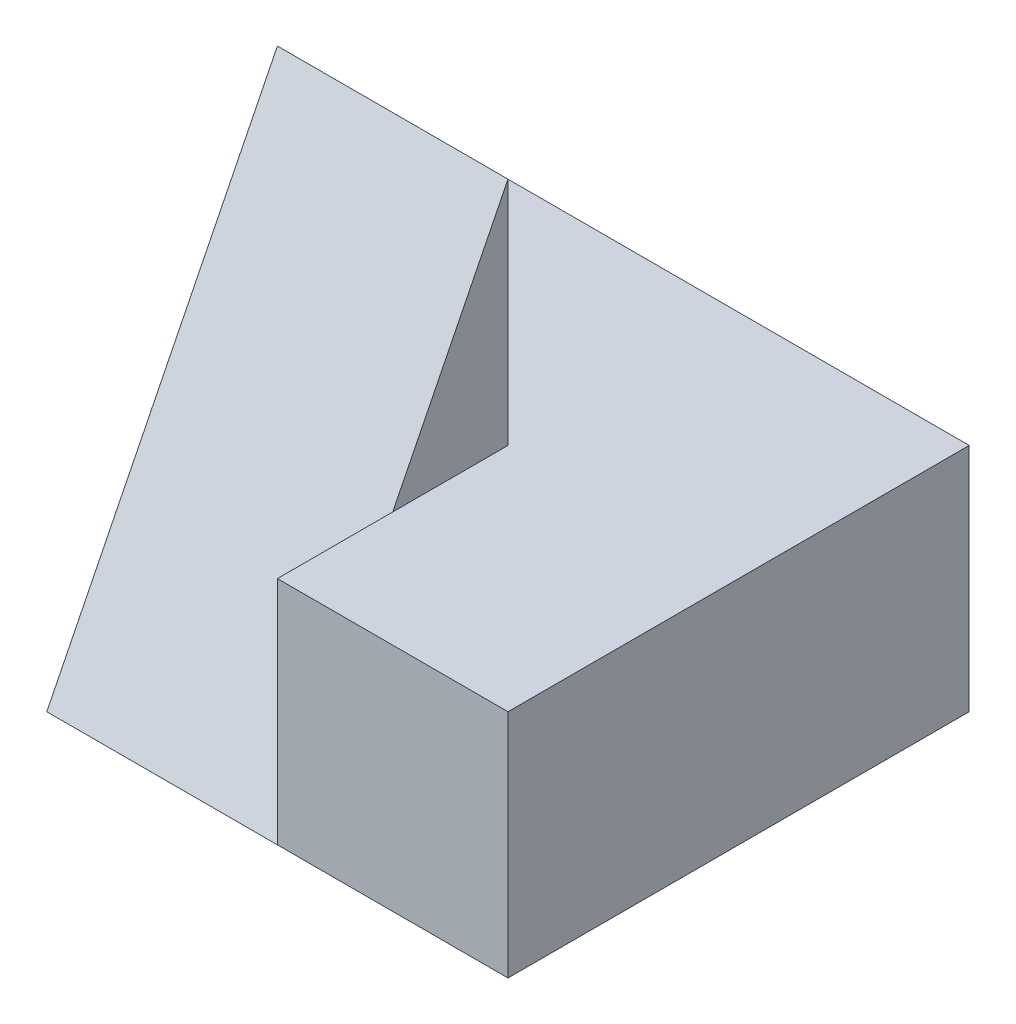
ISO-10303-21;
HEADER;
FILE_DESCRIPTION(('STEP AP214'),'2;1');
FILE_NAME('part.step','',(''),(''),'','','');
FILE_SCHEMA(('AUTOMOTIVE_DESIGN { 1 0 10303 214 1 1 1 1 }'));
ENDSEC;
DATA;
#1=APPLICATION_CONTEXT('core data for automotive mechanical design processes');
#2=APPLICATION_PROTOCOL_DEFINITION('international standard','automotive_design',2000,#1);
#3=PRODUCT_CONTEXT('',#1,'mechanical');
#4=PRODUCT('Part','Part','',(#3));
#5=PRODUCT_RELATED_PRODUCT_CATEGORY('part','',(#4));
#6=PRODUCT_DEFINITION_FORMATION('','',#4);
#7=PRODUCT_DEFINITION_CONTEXT('part definition',#1,'design');
#8=PRODUCT_DEFINITION('design','',#6,#7);
#9=PRODUCT_DEFINITION_SHAPE('','',#8);
#10=(LENGTH_UNIT() NAMED_UNIT(*) SI_UNIT(.MILLI.,.METRE.));
#11=(NAMED_UNIT(*) PLANE_ANGLE_UNIT() SI_UNIT($,.RADIAN.));
#12=(NAMED_UNIT(*) SI_UNIT($,.STERADIAN.) SOLID_ANGLE_UNIT());
#13=UNCERTAINTY_MEASURE_WITH_UNIT(LENGTH_MEASURE(1.E-05),#10,'distance_accuracy_value','');
#14=(GEOMETRIC_REPRESENTATION_CONTEXT(3) GLOBAL_UNCERTAINTY_ASSIGNED_CONTEXT((#13)) GLOBAL_UNIT_ASSIGNED_CONTEXT((#10,
#11,#12)) REPRESENTATION_CONTEXT('',''));
#15=CARTESIAN_POINT('',(0.,0.,0.));
#16=DIRECTION('',(0.,0.,1.));
#17=DIRECTION('',(1.,0.,0.));
#18=AXIS2_PLACEMENT_3D('',#15,#16,#17);
#19=CARTESIAN_POINT('',(0.,4.,0.));
#20=DIRECTION('',(0.,0.,-1.));
#21=DIRECTION('',(-1.,0.,0.));
#22=AXIS2_PLACEMENT_3D('',#19,#20,#21);
#23=PLANE('',#22);
#24=DIRECTION('',(0.,1.,0.));
#25=VECTOR('',#24,1.);
#26=CARTESIAN_POINT('',(2.,4.,0.));
#27=LINE('',#26,#25);
#28=CARTESIAN_POINT('',(2.,0.,0.));
#29=VERTEX_POINT('',#28);
#30=CARTESIAN_POINT('',(2.,2.,0.));
#31=VERTEX_POINT('',#30);
#32=EDGE_CURVE('E144',#29,#31,#27,.T.);
#33=ORIENTED_EDGE('',*,*,#32,.F.);
#34=DIRECTION('',(1.,0.,0.));
#35=VECTOR('',#34,1.);
#36=CARTESIAN_POINT('',(0.,0.,0.));
#37=LINE('',#36,#35);
#38=CARTESIAN_POINT('',(4.,0.,0.));
#39=VERTEX_POINT('',#38);
#40=EDGE_CURVE('E128',#29,#39,#37,.T.);
#41=ORIENTED_EDGE('',*,*,#40,.T.);
#42=DIRECTION('',(0.,-1.,0.));
#43=VECTOR('',#42,1.);
#44=CARTESIAN_POINT('',(4.,4.,0.));
#45=LINE('',#44,#43);
#46=CARTESIAN_POINT('',(4.,2.,0.));
#47=VERTEX_POINT('',#46);
#48=EDGE_CURVE('E11',#47,#39,#45,.T.);
#49=ORIENTED_EDGE('',*,*,#48,.F.);
#50=DIRECTION('',(1.,0.,0.));
#51=VECTOR('',#50,1.);
#52=CARTESIAN_POINT('',(0.,2.,0.));
#53=LINE('',#52,#51);
#54=EDGE_CURVE('E151',#31,#47,#53,.T.);
#55=ORIENTED_EDGE('',*,*,#54,.F.);
#56=EDGE_LOOP('',(#33,#41,#49,#55));
#57=FACE_BOUND('',#56,.T.);
#58=ADVANCED_FACE('F35',(#57),#23,.F.);
#59=CARTESIAN_POINT('',(4.,4.,0.));
#60=DIRECTION('',(-1.,0.,0.));
#61=DIRECTION('',(0.,0.,1.));
#62=AXIS2_PLACEMENT_3D('',#59,#60,#61);
#63=PLANE('',#62);
#64=DIRECTION('',(0.,0.,-1.));
#65=VECTOR('',#64,1.);
#66=CARTESIAN_POINT('',(4.,2.,0.));
#67=LINE('',#66,#65);
#68=CARTESIAN_POINT('',(4.,2.,-4.));
#69=VERTEX_POINT('',#68);
#70=EDGE_CURVE('E153',#47,#69,#67,.T.);
#71=ORIENTED_EDGE('',*,*,#70,.F.);
#72=ORIENTED_EDGE('',*,*,#48,.T.);
#73=DIRECTION('',(0.,0.,-1.));
#74=VECTOR('',#73,1.);
#75=CARTESIAN_POINT('',(4.,0.,0.));
#76=LINE('',#75,#74);
#77=CARTESIAN_POINT('',(4.,0.,-4.));
#78=VERTEX_POINT('',#77);
#79=EDGE_CURVE('E131',#39,#78,#76,.T.);
#80=ORIENTED_EDGE('',*,*,#79,.T.);
#81=DIRECTION('',(0.,-1.,0.));
#82=VECTOR('',#81,1.);
#83=CARTESIAN_POINT('',(4.,4.,-4.));
#84=LINE('',#83,#82);
#85=EDGE_CURVE('E43',#69,#78,#84,.T.);
#86=ORIENTED_EDGE('',*,*,#85,.F.);
#87=EDGE_LOOP('',(#71,#72,#80,#86));
#88=FACE_BOUND('',#87,.T.);
#89=ADVANCED_FACE('F159',(#88),#63,.F.);
#90=CARTESIAN_POINT('',(0.,4.,-4.));
#91=DIRECTION('',(0.,0.,1.));
#92=DIRECTION('',(1.,0.,0.));
#93=AXIS2_PLACEMENT_3D('',#90,#91,#92);
#94=PLANE('',#93);
#95=DIRECTION('',(-1.,0.,0.));
#96=VECTOR('',#95,1.);
#97=CARTESIAN_POINT('',(0.,2.,-4.));
#98=LINE('',#97,#96);
#99=CARTESIAN_POINT('',(0.,2.,-4.));
#100=VERTEX_POINT('',#99);
#101=EDGE_CURVE('E124',#69,#100,#98,.T.);
#102=ORIENTED_EDGE('',*,*,#101,.F.);
#103=ORIENTED_EDGE('',*,*,#85,.T.);
#104=DIRECTION('',(-1.,0.,0.));
#105=VECTOR('',#104,1.);
#106=CARTESIAN_POINT('',(0.,0.,-4.));
#107=LINE('',#106,#105);
#108=CARTESIAN_POINT('',(0.,0.,-4.));
#109=VERTEX_POINT('',#108);
#110=EDGE_CURVE('E133',#78,#109,#107,.T.);
#111=ORIENTED_EDGE('',*,*,#110,.T.);
#112=DIRECTION('',(0.,-1.,0.));
#113=VECTOR('',#112,1.);
#114=CARTESIAN_POINT('',(0.,4.,-4.));
#115=LINE('',#114,#113);
#116=EDGE_CURVE('E50',#100,#109,#115,.T.);
#117=ORIENTED_EDGE('',*,*,#116,.F.);
#118=EDGE_LOOP('',(#102,#103,#111,#117));
#119=FACE_BOUND('',#118,.T.);
#120=ADVANCED_FACE('F137',(#119),#94,.F.);
#121=CARTESIAN_POINT('',(0.,4.,0.));
#122=DIRECTION('',(1.,0.,0.));
#123=DIRECTION('',(0.,0.,-1.));
#124=AXIS2_PLACEMENT_3D('',#121,#122,#123);
#125=PLANE('',#124);
#126=DIRECTION('',(0.,0.,1.));
#127=VECTOR('',#126,1.);
#128=CARTESIAN_POINT('',(0.,0.,0.));
#129=LINE('',#128,#127);
#130=CARTESIAN_POINT('',(0.,0.,0.));
#131=VERTEX_POINT('',#130);
#132=EDGE_CURVE('E121',#109,#131,#129,.T.);
#133=ORIENTED_EDGE('',*,*,#132,.T.);
#134=DIRECTION('',(0.,-0.894427190999916,0.447213595499958));
#135=VECTOR('',#134,1.);
#136=CARTESIAN_POINT('',(0.,0.,0.));
#137=LINE('',#136,#135);
#138=CARTESIAN_POINT('',(0.,4.,-2.));
#139=VERTEX_POINT('',#138);
#140=EDGE_CURVE('E143',#139,#131,#137,.T.);
#141=ORIENTED_EDGE('',*,*,#140,.F.);
#142=DIRECTION('',(0.,1.,0.));
#143=VECTOR('',#142,1.);
#144=CARTESIAN_POINT('',(0.,2.,-2.));
#145=LINE('',#144,#143);
#146=CARTESIAN_POINT('',(0.,2.,-2.));
#147=VERTEX_POINT('',#146);
#148=EDGE_CURVE('E113',#147,#139,#145,.T.);
#149=ORIENTED_EDGE('',*,*,#148,.F.);
#150=DIRECTION('',(0.,0.,1.));
#151=VECTOR('',#150,1.);
#152=CARTESIAN_POINT('',(0.,2.,0.));
#153=LINE('',#152,#151);
#154=EDGE_CURVE('E119',#100,#147,#153,.T.);
#155=ORIENTED_EDGE('',*,*,#154,.F.);
#156=ORIENTED_EDGE('',*,*,#116,.T.);
#157=EDGE_LOOP('',(#133,#141,#149,#155,#156));
#158=FACE_BOUND('',#157,.T.);
#159=ADVANCED_FACE('F37',(#158),#125,.F.);
#160=CARTESIAN_POINT('',(0.,0.,0.));
#161=DIRECTION('',(0.,-1.,0.));
#162=DIRECTION('',(0.,0.,-1.));
#163=AXIS2_PLACEMENT_3D('',#160,#161,#162);
#164=PLANE('',#163);
#165=ORIENTED_EDGE('',*,*,#132,.F.);
#166=ORIENTED_EDGE('',*,*,#110,.F.);
#167=ORIENTED_EDGE('',*,*,#79,.F.);
#168=ORIENTED_EDGE('',*,*,#40,.F.);
#169=EDGE_CURVE('E129',#131,#29,#37,.T.);
#170=ORIENTED_EDGE('',*,*,#169,.F.);
#171=EDGE_LOOP('',(#165,#166,#167,#168,#170));
#172=FACE_BOUND('',#171,.T.);
#173=ADVANCED_FACE('F141',(#172),#164,.T.);
#174=CARTESIAN_POINT('',(0.,2.,-2.));
#175=DIRECTION('',(0.,0.,1.));
#176=DIRECTION('',(1.,0.,0.));
#177=AXIS2_PLACEMENT_3D('',#174,#175,#176);
#178=PLANE('',#177);
#179=DIRECTION('',(1.,0.,0.));
#180=VECTOR('',#179,1.);
#181=CARTESIAN_POINT('',(0.,4.,-2.));
#182=LINE('',#181,#180);
#183=CARTESIAN_POINT('',(2.,4.,-2.));
#184=VERTEX_POINT('',#183);
#185=EDGE_CURVE('E99',#139,#184,#182,.T.);
#186=ORIENTED_EDGE('',*,*,#185,.T.);
#187=DIRECTION('',(0.,1.,0.));
#188=VECTOR('',#187,1.);
#189=CARTESIAN_POINT('',(2.,2.,-2.));
#190=LINE('',#189,#188);
#191=CARTESIAN_POINT('',(2.,2.,-2.));
#192=VERTEX_POINT('',#191);
#193=EDGE_CURVE('E111',#192,#184,#190,.T.);
#194=ORIENTED_EDGE('',*,*,#193,.F.);
#195=DIRECTION('',(1.,0.,0.));
#196=VECTOR('',#195,1.);
#197=CARTESIAN_POINT('',(0.,2.,-2.));
#198=LINE('',#197,#196);
#199=EDGE_CURVE('E114',#147,#192,#198,.T.);
#200=ORIENTED_EDGE('',*,*,#199,.F.);
#201=ORIENTED_EDGE('',*,*,#148,.T.);
#202=EDGE_LOOP('',(#186,#194,#200,#201));
#203=FACE_BOUND('',#202,.T.);
#204=ADVANCED_FACE('F110',(#203),#178,.F.);
#205=CARTESIAN_POINT('',(2.,2.,0.));
#206=DIRECTION('',(-1.,0.,0.));
#207=DIRECTION('',(0.,0.,1.));
#208=AXIS2_PLACEMENT_3D('',#205,#206,#207);
#209=PLANE('',#208);
#210=ORIENTED_EDGE('',*,*,#193,.T.);
#211=DIRECTION('',(0.,-0.894427190999916,0.447213595499958));
#212=VECTOR('',#211,1.);
#213=CARTESIAN_POINT('',(2.,0.,0.));
#214=LINE('',#213,#212);
#215=CARTESIAN_POINT('',(2.,2.,-1.));
#216=VERTEX_POINT('',#215);
#217=EDGE_CURVE('E96',#184,#216,#214,.T.);
#218=ORIENTED_EDGE('',*,*,#217,.T.);
#219=DIRECTION('',(0.,0.,1.));
#220=VECTOR('',#219,1.);
#221=CARTESIAN_POINT('',(2.,2.,0.));
#222=LINE('',#221,#220);
#223=EDGE_CURVE('E117',#192,#216,#222,.T.);
#224=ORIENTED_EDGE('',*,*,#223,.F.);
#225=EDGE_LOOP('',(#210,#218,#224));
#226=FACE_BOUND('',#225,.T.);
#227=ADVANCED_FACE('F116',(#226),#209,.F.);
#228=CARTESIAN_POINT('',(0.,2.,0.));
#229=DIRECTION('',(0.,1.,0.));
#230=DIRECTION('',(0.,0.,1.));
#231=AXIS2_PLACEMENT_3D('',#228,#229,#230);
#232=PLANE('',#231);
#233=ORIENTED_EDGE('',*,*,#199,.T.);
#234=ORIENTED_EDGE('',*,*,#223,.T.);
#235=EDGE_CURVE('E149',#216,#31,#222,.T.);
#236=ORIENTED_EDGE('',*,*,#235,.T.);
#237=ORIENTED_EDGE('',*,*,#54,.T.);
#238=ORIENTED_EDGE('',*,*,#70,.T.);
#239=ORIENTED_EDGE('',*,*,#101,.T.);
#240=ORIENTED_EDGE('',*,*,#154,.T.);
#241=EDGE_LOOP('',(#233,#234,#236,#237,#238,#239,#240));
#242=FACE_BOUND('',#241,.T.);
#243=ADVANCED_FACE('F156',(#242),#232,.T.);
#244=CARTESIAN_POINT('',(2.,0.,0.));
#245=DIRECTION('',(0.,-0.447213595499958,-0.894427190999916));
#246=DIRECTION('',(0.,0.894427190999916,-0.447213595499958));
#247=AXIS2_PLACEMENT_3D('',#244,#245,#246);
#248=PLANE('',#247);
#249=ORIENTED_EDGE('',*,*,#140,.T.);
#250=ORIENTED_EDGE('',*,*,#169,.T.);
#251=EDGE_CURVE('E102',#216,#29,#214,.T.);
#252=ORIENTED_EDGE('',*,*,#251,.F.);
#253=ORIENTED_EDGE('',*,*,#217,.F.);
#254=ORIENTED_EDGE('',*,*,#185,.F.);
#255=EDGE_LOOP('',(#249,#250,#252,#253,#254));
#256=FACE_BOUND('',#255,.T.);
#257=ADVANCED_FACE('F98',(#256),#248,.F.);
#258=CARTESIAN_POINT('',(2.,0.,0.));
#259=DIRECTION('',(-1.,0.,0.));
#260=DIRECTION('',(0.,0.,1.));
#261=AXIS2_PLACEMENT_3D('',#258,#259,#260);
#262=PLANE('',#261);
#263=ORIENTED_EDGE('',*,*,#251,.T.);
#264=ORIENTED_EDGE('',*,*,#32,.T.);
#265=ORIENTED_EDGE('',*,*,#235,.F.);
#266=EDGE_LOOP('',(#263,#264,#265));
#267=FACE_BOUND('',#266,.T.);
#268=ADVANCED_FACE('F166',(#267),#262,.T.);
#269=CLOSED_SHELL('',(#58,#89,#120,#159,#173,#204,#227,#243,#257,#268));
#270=MANIFOLD_SOLID_BREP('B2',#269);
#271=ADVANCED_BREP_SHAPE_REPRESENTATION('',(#18,#270),#14);
#272=SHAPE_DEFINITION_REPRESENTATION(#9,#271);
ENDSEC;
END-ISO-10303-21;
